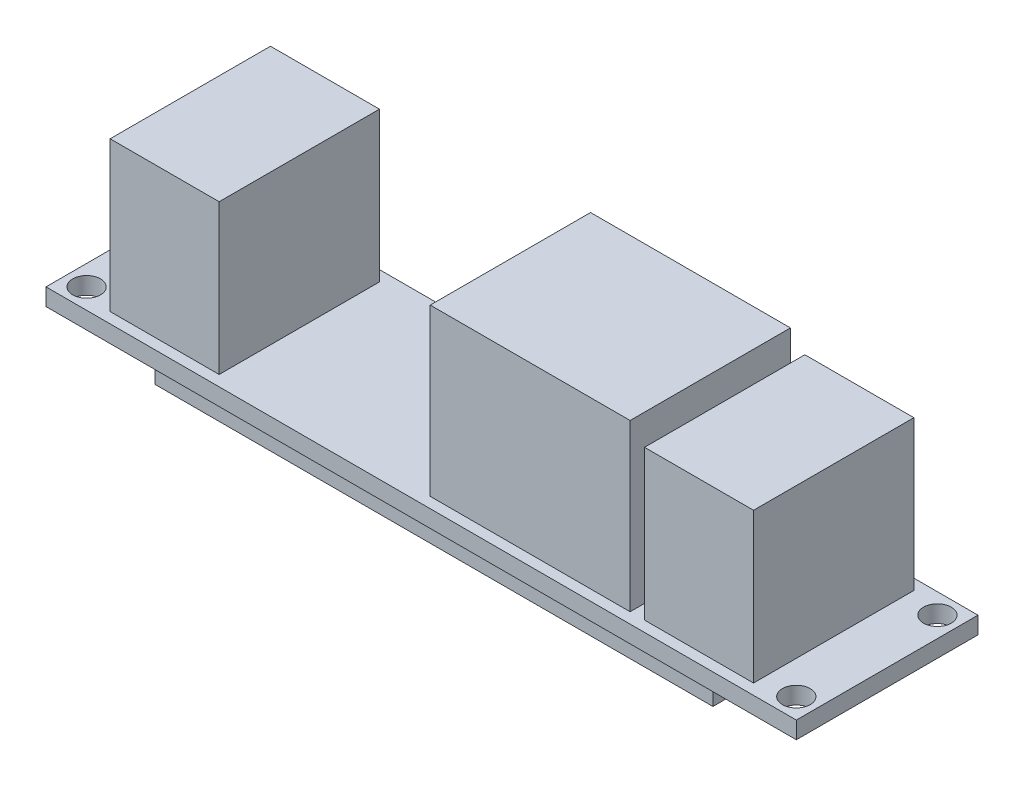
ISO-10303-21;
HEADER;
FILE_DESCRIPTION(('STEP AP214'),'2;1');
FILE_NAME('part.step','',(''),(''),'','','');
FILE_SCHEMA(('AUTOMOTIVE_DESIGN { 1 0 10303 214 1 1 1 1 }'));
ENDSEC;
DATA;
#1=APPLICATION_CONTEXT('core data for automotive mechanical design processes');
#2=APPLICATION_PROTOCOL_DEFINITION('international standard','automotive_design',2000,#1);
#3=PRODUCT_CONTEXT('',#1,'mechanical');
#4=PRODUCT('Part','Part','',(#3));
#5=PRODUCT_RELATED_PRODUCT_CATEGORY('part','',(#4));
#6=PRODUCT_DEFINITION_FORMATION('','',#4);
#7=PRODUCT_DEFINITION_CONTEXT('part definition',#1,'design');
#8=PRODUCT_DEFINITION('design','',#6,#7);
#9=PRODUCT_DEFINITION_SHAPE('','',#8);
#10=(LENGTH_UNIT() NAMED_UNIT(*) SI_UNIT(.MILLI.,.METRE.));
#11=(NAMED_UNIT(*) PLANE_ANGLE_UNIT() SI_UNIT($,.RADIAN.));
#12=(NAMED_UNIT(*) SI_UNIT($,.STERADIAN.) SOLID_ANGLE_UNIT());
#13=UNCERTAINTY_MEASURE_WITH_UNIT(LENGTH_MEASURE(1.E-05),#10,'distance_accuracy_value','');
#14=(GEOMETRIC_REPRESENTATION_CONTEXT(3) GLOBAL_UNCERTAINTY_ASSIGNED_CONTEXT((#13)) GLOBAL_UNIT_ASSIGNED_CONTEXT((#10,
#11,#12)) REPRESENTATION_CONTEXT('',''));
#15=CARTESIAN_POINT('',(0.,0.,0.));
#16=DIRECTION('',(0.,0.,1.));
#17=DIRECTION('',(1.,0.,0.));
#18=AXIS2_PLACEMENT_3D('',#15,#16,#17);
#19=CARTESIAN_POINT('',(0.,-1.6,0.));
#20=DIRECTION('',(0.,-1.,0.));
#21=DIRECTION('',(0.,0.,-1.));
#22=AXIS2_PLACEMENT_3D('',#19,#20,#21);
#23=PLANE('',#22);
#24=CARTESIAN_POINT('',(-33.2,-1.6,6.6));
#25=DIRECTION('',(0.,1.,0.));
#26=DIRECTION('',(0.,0.,-1.));
#27=AXIS2_PLACEMENT_3D('',#24,#25,#26);
#28=CIRCLE('',#27,1.3);
#29=CARTESIAN_POINT('',(-33.2,-1.6,5.3));
#30=VERTEX_POINT('',#29);
#31=EDGE_CURVE('E291',#30,#30,#28,.T.);
#32=ORIENTED_EDGE('',*,*,#31,.T.);
#33=EDGE_LOOP('',(#32));
#34=FACE_BOUND('',#33,.T.);
#35=CARTESIAN_POINT('',(33.2,-1.6,6.6));
#36=DIRECTION('',(0.,1.,0.));
#37=DIRECTION('',(0.,0.,1.));
#38=AXIS2_PLACEMENT_3D('',#35,#36,#37);
#39=CIRCLE('',#38,1.3);
#40=CARTESIAN_POINT('',(33.2,-1.6,7.9));
#41=VERTEX_POINT('',#40);
#42=EDGE_CURVE('E297',#41,#41,#39,.T.);
#43=ORIENTED_EDGE('',*,*,#42,.T.);
#44=EDGE_LOOP('',(#43));
#45=FACE_BOUND('',#44,.T.);
#46=CARTESIAN_POINT('',(33.2,-1.6,-6.6));
#47=DIRECTION('',(0.,1.,0.));
#48=DIRECTION('',(0.,0.,-1.));
#49=AXIS2_PLACEMENT_3D('',#46,#47,#48);
#50=CIRCLE('',#49,1.3);
#51=CARTESIAN_POINT('',(33.2,-1.6,-7.9));
#52=VERTEX_POINT('',#51);
#53=EDGE_CURVE('E303',#52,#52,#50,.T.);
#54=ORIENTED_EDGE('',*,*,#53,.T.);
#55=EDGE_LOOP('',(#54));
#56=FACE_BOUND('',#55,.T.);
#57=CARTESIAN_POINT('',(-33.2,-1.6,-6.6));
#58=DIRECTION('',(0.,1.,0.));
#59=DIRECTION('',(0.,0.,1.));
#60=AXIS2_PLACEMENT_3D('',#57,#58,#59);
#61=CIRCLE('',#60,1.3);
#62=CARTESIAN_POINT('',(-33.2,-1.6,-5.3));
#63=VERTEX_POINT('',#62);
#64=EDGE_CURVE('E309',#63,#63,#61,.T.);
#65=ORIENTED_EDGE('',*,*,#64,.T.);
#66=EDGE_LOOP('',(#65));
#67=FACE_BOUND('',#66,.T.);
#68=DIRECTION('',(0.,0.,-1.));
#69=VECTOR('',#68,1.);
#70=CARTESIAN_POINT('',(35.1,-1.6,8.5));
#71=LINE('',#70,#69);
#72=CARTESIAN_POINT('',(35.1,-1.6,8.5));
#73=VERTEX_POINT('',#72);
#74=CARTESIAN_POINT('',(35.1,-1.6,-8.5));
#75=VERTEX_POINT('',#74);
#76=EDGE_CURVE('E315',#73,#75,#71,.T.);
#77=ORIENTED_EDGE('',*,*,#76,.F.);
#78=DIRECTION('',(1.,0.,0.));
#79=VECTOR('',#78,1.);
#80=CARTESIAN_POINT('',(-35.1,-1.6,8.5));
#81=LINE('',#80,#79);
#82=CARTESIAN_POINT('',(-35.1,-1.6,8.5));
#83=VERTEX_POINT('',#82);
#84=EDGE_CURVE('E325',#83,#73,#81,.T.);
#85=ORIENTED_EDGE('',*,*,#84,.F.);
#86=DIRECTION('',(0.,0.,1.));
#87=VECTOR('',#86,1.);
#88=CARTESIAN_POINT('',(-35.1,-1.6,8.5));
#89=LINE('',#88,#87);
#90=CARTESIAN_POINT('',(-35.1,-1.6,-8.5));
#91=VERTEX_POINT('',#90);
#92=EDGE_CURVE('E322',#91,#83,#89,.T.);
#93=ORIENTED_EDGE('',*,*,#92,.F.);
#94=DIRECTION('',(-1.,0.,0.));
#95=VECTOR('',#94,1.);
#96=CARTESIAN_POINT('',(-35.1,-1.6,-8.5));
#97=LINE('',#96,#95);
#98=EDGE_CURVE('E318',#75,#91,#97,.T.);
#99=ORIENTED_EDGE('',*,*,#98,.F.);
#100=EDGE_LOOP('',(#77,#85,#93,#99));
#101=FACE_BOUND('',#100,.T.);
#102=DIRECTION('',(-1.,0.,0.));
#103=VECTOR('',#102,1.);
#104=CARTESIAN_POINT('',(-26.1,-1.6,7.30352740908692));
#105=LINE('',#104,#103);
#106=CARTESIAN_POINT('',(26.1,-1.6,7.30352740908692));
#107=VERTEX_POINT('',#106);
#108=CARTESIAN_POINT('',(-26.1,-1.6,7.30352740908692));
#109=VERTEX_POINT('',#108);
#110=EDGE_CURVE('E656',#107,#109,#105,.T.);
#111=ORIENTED_EDGE('',*,*,#110,.F.);
#112=DIRECTION('',(0.,0.,1.));
#113=VECTOR('',#112,1.);
#114=CARTESIAN_POINT('',(26.1,-1.6,-7.30352740908692));
#115=LINE('',#114,#113);
#116=CARTESIAN_POINT('',(26.1,-1.6,-7.30352740908692));
#117=VERTEX_POINT('',#116);
#118=EDGE_CURVE('E196',#117,#107,#115,.T.);
#119=ORIENTED_EDGE('',*,*,#118,.F.);
#120=DIRECTION('',(1.,0.,0.));
#121=VECTOR('',#120,1.);
#122=CARTESIAN_POINT('',(-26.1,-1.6,-7.30352740908692));
#123=LINE('',#122,#121);
#124=CARTESIAN_POINT('',(-26.1,-1.6,-7.30352740908692));
#125=VERTEX_POINT('',#124);
#126=EDGE_CURVE('E192',#125,#117,#123,.T.);
#127=ORIENTED_EDGE('',*,*,#126,.F.);
#128=DIRECTION('',(0.,0.,-1.));
#129=VECTOR('',#128,1.);
#130=CARTESIAN_POINT('',(-26.1,-1.6,-7.30352740908692));
#131=LINE('',#130,#129);
#132=EDGE_CURVE('E653',#109,#125,#131,.T.);
#133=ORIENTED_EDGE('',*,*,#132,.F.);
#134=EDGE_LOOP('',(#111,#119,#127,#133));
#135=FACE_BOUND('',#134,.T.);
#136=ADVANCED_FACE('F35',(#34,#45,#56,#67,#101,#135),#23,.T.);
#137=CARTESIAN_POINT('',(0.,0.,0.));
#138=DIRECTION('',(0.,-1.,0.));
#139=DIRECTION('',(0.,0.,-1.));
#140=AXIS2_PLACEMENT_3D('',#137,#138,#139);
#141=PLANE('',#140);
#142=DIRECTION('',(1.,0.,0.));
#143=VECTOR('',#142,1.);
#144=CARTESIAN_POINT('',(19.9,0.,7.5));
#145=LINE('',#144,#143);
#146=CARTESIAN_POINT('',(19.9,0.,7.5));
#147=VERTEX_POINT('',#146);
#148=CARTESIAN_POINT('',(30.1,0.,7.5));
#149=VERTEX_POINT('',#148);
#150=EDGE_CURVE('E233',#147,#149,#145,.T.);
#151=ORIENTED_EDGE('',*,*,#150,.F.);
#152=DIRECTION('',(0.,0.,-1.));
#153=VECTOR('',#152,1.);
#154=CARTESIAN_POINT('',(19.9,0.,7.5));
#155=LINE('',#154,#153);
#156=CARTESIAN_POINT('',(19.9,0.,-7.5));
#157=VERTEX_POINT('',#156);
#158=EDGE_CURVE('E257',#147,#157,#155,.T.);
#159=ORIENTED_EDGE('',*,*,#158,.T.);
#160=DIRECTION('',(1.,0.,0.));
#161=VECTOR('',#160,1.);
#162=CARTESIAN_POINT('',(19.9,0.,-7.5));
#163=LINE('',#162,#161);
#164=CARTESIAN_POINT('',(30.1,0.,-7.5));
#165=VERTEX_POINT('',#164);
#166=EDGE_CURVE('E243',#157,#165,#163,.T.);
#167=ORIENTED_EDGE('',*,*,#166,.T.);
#168=DIRECTION('',(0.,0.,-1.));
#169=VECTOR('',#168,1.);
#170=CARTESIAN_POINT('',(30.1,0.,7.5));
#171=LINE('',#170,#169);
#172=EDGE_CURVE('E254',#149,#165,#171,.T.);
#173=ORIENTED_EDGE('',*,*,#172,.F.);
#174=EDGE_LOOP('',(#151,#159,#167,#173));
#175=FACE_BOUND('',#174,.T.);
#176=DIRECTION('',(0.,0.,-1.));
#177=VECTOR('',#176,1.);
#178=CARTESIAN_POINT('',(35.1,0.,8.5));
#179=LINE('',#178,#177);
#180=CARTESIAN_POINT('',(35.1,0.,8.5));
#181=VERTEX_POINT('',#180);
#182=CARTESIAN_POINT('',(35.1,0.,-8.5));
#183=VERTEX_POINT('',#182);
#184=EDGE_CURVE('E312',#181,#183,#179,.T.);
#185=ORIENTED_EDGE('',*,*,#184,.T.);
#186=DIRECTION('',(-1.,0.,0.));
#187=VECTOR('',#186,1.);
#188=CARTESIAN_POINT('',(-35.1,0.,-8.5));
#189=LINE('',#188,#187);
#190=CARTESIAN_POINT('',(-35.1,0.,-8.5));
#191=VERTEX_POINT('',#190);
#192=EDGE_CURVE('E330',#183,#191,#189,.T.);
#193=ORIENTED_EDGE('',*,*,#192,.T.);
#194=DIRECTION('',(0.,0.,1.));
#195=VECTOR('',#194,1.);
#196=CARTESIAN_POINT('',(-35.1,0.,8.5));
#197=LINE('',#196,#195);
#198=CARTESIAN_POINT('',(-35.1,0.,8.5));
#199=VERTEX_POINT('',#198);
#200=EDGE_CURVE('E333',#191,#199,#197,.T.);
#201=ORIENTED_EDGE('',*,*,#200,.T.);
#202=DIRECTION('',(1.,0.,0.));
#203=VECTOR('',#202,1.);
#204=CARTESIAN_POINT('',(-35.1,0.,8.5));
#205=LINE('',#204,#203);
#206=EDGE_CURVE('E319',#199,#181,#205,.T.);
#207=ORIENTED_EDGE('',*,*,#206,.T.);
#208=EDGE_LOOP('',(#185,#193,#201,#207));
#209=FACE_BOUND('',#208,.T.);
#210=CARTESIAN_POINT('',(-33.2,0.,-6.6));
#211=DIRECTION('',(0.,1.,0.));
#212=DIRECTION('',(0.,0.,1.));
#213=AXIS2_PLACEMENT_3D('',#210,#211,#212);
#214=CIRCLE('',#213,1.3);
#215=CARTESIAN_POINT('',(-33.2,0.,-5.3));
#216=VERTEX_POINT('',#215);
#217=EDGE_CURVE('E306',#216,#216,#214,.T.);
#218=ORIENTED_EDGE('',*,*,#217,.F.);
#219=EDGE_LOOP('',(#218));
#220=FACE_BOUND('',#219,.T.);
#221=CARTESIAN_POINT('',(33.2,0.,-6.6));
#222=DIRECTION('',(0.,1.,0.));
#223=DIRECTION('',(0.,0.,-1.));
#224=AXIS2_PLACEMENT_3D('',#221,#222,#223);
#225=CIRCLE('',#224,1.3);
#226=CARTESIAN_POINT('',(33.2,0.,-7.9));
#227=VERTEX_POINT('',#226);
#228=EDGE_CURVE('E300',#227,#227,#225,.T.);
#229=ORIENTED_EDGE('',*,*,#228,.F.);
#230=EDGE_LOOP('',(#229));
#231=FACE_BOUND('',#230,.T.);
#232=CARTESIAN_POINT('',(33.2,0.,6.6));
#233=DIRECTION('',(0.,1.,0.));
#234=DIRECTION('',(0.,0.,1.));
#235=AXIS2_PLACEMENT_3D('',#232,#233,#234);
#236=CIRCLE('',#235,1.3);
#237=CARTESIAN_POINT('',(33.2,0.,7.9));
#238=VERTEX_POINT('',#237);
#239=EDGE_CURVE('E294',#238,#238,#236,.T.);
#240=ORIENTED_EDGE('',*,*,#239,.F.);
#241=EDGE_LOOP('',(#240));
#242=FACE_BOUND('',#241,.T.);
#243=CARTESIAN_POINT('',(-33.2,0.,6.6));
#244=DIRECTION('',(0.,1.,0.));
#245=DIRECTION('',(0.,0.,-1.));
#246=AXIS2_PLACEMENT_3D('',#243,#244,#245);
#247=CIRCLE('',#246,1.3);
#248=CARTESIAN_POINT('',(-33.2,0.,5.3));
#249=VERTEX_POINT('',#248);
#250=EDGE_CURVE('E290',#249,#249,#247,.T.);
#251=ORIENTED_EDGE('',*,*,#250,.F.);
#252=EDGE_LOOP('',(#251));
#253=FACE_BOUND('',#252,.T.);
#254=DIRECTION('',(1.,0.,0.));
#255=VECTOR('',#254,1.);
#256=CARTESIAN_POINT('',(-0.150000000000004,0.,7.5));
#257=LINE('',#256,#255);
#258=CARTESIAN_POINT('',(-0.150000000000004,0.,7.5));
#259=VERTEX_POINT('',#258);
#260=CARTESIAN_POINT('',(18.55,0.,7.5));
#261=VERTEX_POINT('',#260);
#262=EDGE_CURVE('E263',#259,#261,#257,.T.);
#263=ORIENTED_EDGE('',*,*,#262,.F.);
#264=DIRECTION('',(0.,0.,-1.));
#265=VECTOR('',#264,1.);
#266=CARTESIAN_POINT('',(-0.150000000000004,0.,7.5));
#267=LINE('',#266,#265);
#268=CARTESIAN_POINT('',(-0.150000000000004,0.,-7.5));
#269=VERTEX_POINT('',#268);
#270=EDGE_CURVE('E287',#259,#269,#267,.T.);
#271=ORIENTED_EDGE('',*,*,#270,.T.);
#272=DIRECTION('',(1.,0.,0.));
#273=VECTOR('',#272,1.);
#274=CARTESIAN_POINT('',(-0.150000000000004,0.,-7.5));
#275=LINE('',#274,#273);
#276=CARTESIAN_POINT('',(18.55,0.,-7.5));
#277=VERTEX_POINT('',#276);
#278=EDGE_CURVE('E273',#269,#277,#275,.T.);
#279=ORIENTED_EDGE('',*,*,#278,.T.);
#280=DIRECTION('',(0.,0.,-1.));
#281=VECTOR('',#280,1.);
#282=CARTESIAN_POINT('',(18.55,0.,7.5));
#283=LINE('',#282,#281);
#284=EDGE_CURVE('E284',#261,#277,#283,.T.);
#285=ORIENTED_EDGE('',*,*,#284,.F.);
#286=EDGE_LOOP('',(#263,#271,#279,#285));
#287=FACE_BOUND('',#286,.T.);
#288=DIRECTION('',(1.,0.,0.));
#289=VECTOR('',#288,1.);
#290=CARTESIAN_POINT('',(-30.1,0.,7.5));
#291=LINE('',#290,#289);
#292=CARTESIAN_POINT('',(-30.1,0.,7.5));
#293=VERTEX_POINT('',#292);
#294=CARTESIAN_POINT('',(-19.9,0.,7.5));
#295=VERTEX_POINT('',#294);
#296=EDGE_CURVE('E208',#293,#295,#291,.T.);
#297=ORIENTED_EDGE('',*,*,#296,.F.);
#298=DIRECTION('',(0.,0.,-1.));
#299=VECTOR('',#298,1.);
#300=CARTESIAN_POINT('',(-30.1,0.,7.5));
#301=LINE('',#300,#299);
#302=CARTESIAN_POINT('',(-30.1,0.,-7.5));
#303=VERTEX_POINT('',#302);
#304=EDGE_CURVE('E227',#293,#303,#301,.T.);
#305=ORIENTED_EDGE('',*,*,#304,.T.);
#306=DIRECTION('',(1.,0.,0.));
#307=VECTOR('',#306,1.);
#308=CARTESIAN_POINT('',(-30.1,0.,-7.5));
#309=LINE('',#308,#307);
#310=CARTESIAN_POINT('',(-19.9,0.,-7.5));
#311=VERTEX_POINT('',#310);
#312=EDGE_CURVE('E201',#303,#311,#309,.T.);
#313=ORIENTED_EDGE('',*,*,#312,.T.);
#314=DIRECTION('',(0.,0.,-1.));
#315=VECTOR('',#314,1.);
#316=CARTESIAN_POINT('',(-19.9,0.,7.5));
#317=LINE('',#316,#315);
#318=EDGE_CURVE('E225',#295,#311,#317,.T.);
#319=ORIENTED_EDGE('',*,*,#318,.F.);
#320=EDGE_LOOP('',(#297,#305,#313,#319));
#321=FACE_BOUND('',#320,.T.);
#322=ADVANCED_FACE('F348',(#175,#209,#220,#231,#242,#253,#287,#321),#141,.F.);
#323=CARTESIAN_POINT('',(35.1,-1.6,8.5));
#324=DIRECTION('',(1.,0.,0.));
#325=DIRECTION('',(0.,0.,-1.));
#326=AXIS2_PLACEMENT_3D('',#323,#324,#325);
#327=PLANE('',#326);
#328=ORIENTED_EDGE('',*,*,#184,.F.);
#329=DIRECTION('',(0.,1.,0.));
#330=VECTOR('',#329,1.);
#331=CARTESIAN_POINT('',(35.1,-1.6,8.5));
#332=LINE('',#331,#330);
#333=EDGE_CURVE('E11',#73,#181,#332,.T.);
#334=ORIENTED_EDGE('',*,*,#333,.F.);
#335=ORIENTED_EDGE('',*,*,#76,.T.);
#336=DIRECTION('',(0.,1.,0.));
#337=VECTOR('',#336,1.);
#338=CARTESIAN_POINT('',(35.1,-1.6,-8.5));
#339=LINE('',#338,#337);
#340=EDGE_CURVE('E39',#75,#183,#339,.T.);
#341=ORIENTED_EDGE('',*,*,#340,.T.);
#342=EDGE_LOOP('',(#328,#334,#335,#341));
#343=FACE_BOUND('',#342,.T.);
#344=ADVANCED_FACE('F37',(#343),#327,.T.);
#345=CARTESIAN_POINT('',(-35.1,-1.6,8.5));
#346=DIRECTION('',(0.,0.,1.));
#347=DIRECTION('',(1.,0.,0.));
#348=AXIS2_PLACEMENT_3D('',#345,#346,#347);
#349=PLANE('',#348);
#350=ORIENTED_EDGE('',*,*,#206,.F.);
#351=DIRECTION('',(0.,1.,0.));
#352=VECTOR('',#351,1.);
#353=CARTESIAN_POINT('',(-35.1,-1.6,8.5));
#354=LINE('',#353,#352);
#355=EDGE_CURVE('E44',#83,#199,#354,.T.);
#356=ORIENTED_EDGE('',*,*,#355,.F.);
#357=ORIENTED_EDGE('',*,*,#84,.T.);
#358=ORIENTED_EDGE('',*,*,#333,.T.);
#359=EDGE_LOOP('',(#350,#356,#357,#358));
#360=FACE_BOUND('',#359,.T.);
#361=ADVANCED_FACE('F352',(#360),#349,.T.);
#362=CARTESIAN_POINT('',(-35.1,-1.6,8.5));
#363=DIRECTION('',(-1.,0.,0.));
#364=DIRECTION('',(0.,0.,1.));
#365=AXIS2_PLACEMENT_3D('',#362,#363,#364);
#366=PLANE('',#365);
#367=ORIENTED_EDGE('',*,*,#200,.F.);
#368=DIRECTION('',(0.,1.,0.));
#369=VECTOR('',#368,1.);
#370=CARTESIAN_POINT('',(-35.1,-1.6,-8.5));
#371=LINE('',#370,#369);
#372=EDGE_CURVE('E338',#91,#191,#371,.T.);
#373=ORIENTED_EDGE('',*,*,#372,.F.);
#374=ORIENTED_EDGE('',*,*,#92,.T.);
#375=ORIENTED_EDGE('',*,*,#355,.T.);
#376=EDGE_LOOP('',(#367,#373,#374,#375));
#377=FACE_BOUND('',#376,.T.);
#378=ADVANCED_FACE('F358',(#377),#366,.T.);
#379=CARTESIAN_POINT('',(-35.1,-1.6,-8.5));
#380=DIRECTION('',(0.,0.,-1.));
#381=DIRECTION('',(-1.,0.,0.));
#382=AXIS2_PLACEMENT_3D('',#379,#380,#381);
#383=PLANE('',#382);
#384=ORIENTED_EDGE('',*,*,#192,.F.);
#385=ORIENTED_EDGE('',*,*,#340,.F.);
#386=ORIENTED_EDGE('',*,*,#98,.T.);
#387=ORIENTED_EDGE('',*,*,#372,.T.);
#388=EDGE_LOOP('',(#384,#385,#386,#387));
#389=FACE_BOUND('',#388,.T.);
#390=ADVANCED_FACE('F346',(#389),#383,.T.);
#391=CARTESIAN_POINT('',(-33.2,-1.6,-6.6));
#392=DIRECTION('',(0.,1.,0.));
#393=DIRECTION('',(0.,0.,1.));
#394=AXIS2_PLACEMENT_3D('',#391,#392,#393);
#395=CYLINDRICAL_SURFACE('',#394,1.3);
#396=ORIENTED_EDGE('',*,*,#64,.F.);
#397=EDGE_LOOP('',(#396));
#398=FACE_BOUND('',#397,.T.);
#399=ORIENTED_EDGE('',*,*,#217,.T.);
#400=EDGE_LOOP('',(#399));
#401=FACE_BOUND('',#400,.T.);
#402=ADVANCED_FACE('F365',(#398,#401),#395,.F.);
#403=CARTESIAN_POINT('',(33.2,-1.6,-6.6));
#404=DIRECTION('',(0.,1.,0.));
#405=DIRECTION('',(0.,0.,1.));
#406=AXIS2_PLACEMENT_3D('',#403,#404,#405);
#407=CYLINDRICAL_SURFACE('',#406,1.3);
#408=ORIENTED_EDGE('',*,*,#53,.F.);
#409=EDGE_LOOP('',(#408));
#410=FACE_BOUND('',#409,.T.);
#411=ORIENTED_EDGE('',*,*,#228,.T.);
#412=EDGE_LOOP('',(#411));
#413=FACE_BOUND('',#412,.T.);
#414=ADVANCED_FACE('F379',(#410,#413),#407,.F.);
#415=CARTESIAN_POINT('',(33.2,-1.6,6.6));
#416=DIRECTION('',(0.,1.,0.));
#417=DIRECTION('',(0.,0.,1.));
#418=AXIS2_PLACEMENT_3D('',#415,#416,#417);
#419=CYLINDRICAL_SURFACE('',#418,1.3);
#420=ORIENTED_EDGE('',*,*,#42,.F.);
#421=EDGE_LOOP('',(#420));
#422=FACE_BOUND('',#421,.T.);
#423=ORIENTED_EDGE('',*,*,#239,.T.);
#424=EDGE_LOOP('',(#423));
#425=FACE_BOUND('',#424,.T.);
#426=ADVANCED_FACE('F383',(#422,#425),#419,.F.);
#427=CARTESIAN_POINT('',(-33.2,-1.6,6.6));
#428=DIRECTION('',(0.,1.,0.));
#429=DIRECTION('',(0.,0.,1.));
#430=AXIS2_PLACEMENT_3D('',#427,#428,#429);
#431=CYLINDRICAL_SURFACE('',#430,1.3);
#432=ORIENTED_EDGE('',*,*,#31,.F.);
#433=EDGE_LOOP('',(#432));
#434=FACE_BOUND('',#433,.T.);
#435=ORIENTED_EDGE('',*,*,#250,.T.);
#436=EDGE_LOOP('',(#435));
#437=FACE_BOUND('',#436,.T.);
#438=ADVANCED_FACE('F387',(#434,#437),#431,.F.);
#439=CARTESIAN_POINT('',(-0.150000000000004,0.,7.5));
#440=DIRECTION('',(1.,0.,0.));
#441=DIRECTION('',(0.,0.,-1.));
#442=AXIS2_PLACEMENT_3D('',#439,#440,#441);
#443=PLANE('',#442);
#444=DIRECTION('',(0.,-1.,0.));
#445=VECTOR('',#444,1.);
#446=CARTESIAN_POINT('',(-0.150000000000004,0.,-7.5));
#447=LINE('',#446,#445);
#448=CARTESIAN_POINT('',(-0.150000000000004,15.5,-7.5));
#449=VERTEX_POINT('',#448);
#450=EDGE_CURVE('E260',#449,#269,#447,.T.);
#451=ORIENTED_EDGE('',*,*,#450,.T.);
#452=ORIENTED_EDGE('',*,*,#270,.F.);
#453=DIRECTION('',(0.,-1.,0.));
#454=VECTOR('',#453,1.);
#455=CARTESIAN_POINT('',(-0.150000000000004,0.,7.5));
#456=LINE('',#455,#454);
#457=CARTESIAN_POINT('',(-0.150000000000004,15.5,7.5));
#458=VERTEX_POINT('',#457);
#459=EDGE_CURVE('E261',#458,#259,#456,.T.);
#460=ORIENTED_EDGE('',*,*,#459,.F.);
#461=DIRECTION('',(0.,0.,-1.));
#462=VECTOR('',#461,1.);
#463=CARTESIAN_POINT('',(-0.150000000000004,15.5,7.5));
#464=LINE('',#463,#462);
#465=EDGE_CURVE('E270',#458,#449,#464,.T.);
#466=ORIENTED_EDGE('',*,*,#465,.T.);
#467=EDGE_LOOP('',(#451,#452,#460,#466));
#468=FACE_BOUND('',#467,.T.);
#469=ADVANCED_FACE('F391',(#468),#443,.F.);
#470=CARTESIAN_POINT('',(18.55,0.,7.5));
#471=DIRECTION('',(-1.,0.,0.));
#472=DIRECTION('',(0.,0.,1.));
#473=AXIS2_PLACEMENT_3D('',#470,#471,#472);
#474=PLANE('',#473);
#475=DIRECTION('',(0.,1.,0.));
#476=VECTOR('',#475,1.);
#477=CARTESIAN_POINT('',(18.55,0.,-7.5));
#478=LINE('',#477,#476);
#479=CARTESIAN_POINT('',(18.55,15.5,-7.5));
#480=VERTEX_POINT('',#479);
#481=EDGE_CURVE('E276',#277,#480,#478,.T.);
#482=ORIENTED_EDGE('',*,*,#481,.T.);
#483=DIRECTION('',(0.,0.,-1.));
#484=VECTOR('',#483,1.);
#485=CARTESIAN_POINT('',(18.55,15.5,7.5));
#486=LINE('',#485,#484);
#487=CARTESIAN_POINT('',(18.55,15.5,7.5));
#488=VERTEX_POINT('',#487);
#489=EDGE_CURVE('E281',#488,#480,#486,.T.);
#490=ORIENTED_EDGE('',*,*,#489,.F.);
#491=DIRECTION('',(0.,1.,0.));
#492=VECTOR('',#491,1.);
#493=CARTESIAN_POINT('',(18.55,0.,7.5));
#494=LINE('',#493,#492);
#495=EDGE_CURVE('E266',#261,#488,#494,.T.);
#496=ORIENTED_EDGE('',*,*,#495,.F.);
#497=ORIENTED_EDGE('',*,*,#284,.T.);
#498=EDGE_LOOP('',(#482,#490,#496,#497));
#499=FACE_BOUND('',#498,.T.);
#500=ADVANCED_FACE('F395',(#499),#474,.F.);
#501=CARTESIAN_POINT('',(-0.150000000000004,15.5,7.5));
#502=DIRECTION('',(0.,-1.,0.));
#503=DIRECTION('',(0.,0.,-1.));
#504=AXIS2_PLACEMENT_3D('',#501,#502,#503);
#505=PLANE('',#504);
#506=DIRECTION('',(-1.,0.,0.));
#507=VECTOR('',#506,1.);
#508=CARTESIAN_POINT('',(-0.150000000000004,15.5,-7.5));
#509=LINE('',#508,#507);
#510=EDGE_CURVE('E264',#480,#449,#509,.T.);
#511=ORIENTED_EDGE('',*,*,#510,.T.);
#512=ORIENTED_EDGE('',*,*,#465,.F.);
#513=DIRECTION('',(-1.,0.,0.));
#514=VECTOR('',#513,1.);
#515=CARTESIAN_POINT('',(-0.150000000000004,15.5,7.5));
#516=LINE('',#515,#514);
#517=EDGE_CURVE('E268',#488,#458,#516,.T.);
#518=ORIENTED_EDGE('',*,*,#517,.F.);
#519=ORIENTED_EDGE('',*,*,#489,.T.);
#520=EDGE_LOOP('',(#511,#512,#518,#519));
#521=FACE_BOUND('',#520,.T.);
#522=ADVANCED_FACE('F399',(#521),#505,.F.);
#523=CARTESIAN_POINT('',(0.,0.,7.5));
#524=DIRECTION('',(0.,0.,-1.));
#525=DIRECTION('',(-1.,0.,0.));
#526=AXIS2_PLACEMENT_3D('',#523,#524,#525);
#527=PLANE('',#526);
#528=ORIENTED_EDGE('',*,*,#459,.T.);
#529=ORIENTED_EDGE('',*,*,#262,.T.);
#530=ORIENTED_EDGE('',*,*,#495,.T.);
#531=ORIENTED_EDGE('',*,*,#517,.T.);
#532=EDGE_LOOP('',(#528,#529,#530,#531));
#533=FACE_BOUND('',#532,.T.);
#534=ADVANCED_FACE('F403',(#533),#527,.F.);
#535=CARTESIAN_POINT('',(0.,0.,-7.5));
#536=DIRECTION('',(0.,0.,-1.));
#537=DIRECTION('',(-1.,0.,0.));
#538=AXIS2_PLACEMENT_3D('',#535,#536,#537);
#539=PLANE('',#538);
#540=ORIENTED_EDGE('',*,*,#450,.F.);
#541=ORIENTED_EDGE('',*,*,#510,.F.);
#542=ORIENTED_EDGE('',*,*,#481,.F.);
#543=ORIENTED_EDGE('',*,*,#278,.F.);
#544=EDGE_LOOP('',(#540,#541,#542,#543));
#545=FACE_BOUND('',#544,.T.);
#546=ADVANCED_FACE('F405',(#545),#539,.T.);
#547=CARTESIAN_POINT('',(19.9,0.,7.5));
#548=DIRECTION('',(1.,0.,0.));
#549=DIRECTION('',(0.,0.,-1.));
#550=AXIS2_PLACEMENT_3D('',#547,#548,#549);
#551=PLANE('',#550);
#552=DIRECTION('',(0.,-1.,0.));
#553=VECTOR('',#552,1.);
#554=CARTESIAN_POINT('',(19.9,0.,-7.5));
#555=LINE('',#554,#553);
#556=CARTESIAN_POINT('',(19.9,14.,-7.5));
#557=VERTEX_POINT('',#556);
#558=EDGE_CURVE('E230',#557,#157,#555,.T.);
#559=ORIENTED_EDGE('',*,*,#558,.T.);
#560=ORIENTED_EDGE('',*,*,#158,.F.);
#561=DIRECTION('',(0.,-1.,0.));
#562=VECTOR('',#561,1.);
#563=CARTESIAN_POINT('',(19.9,0.,7.5));
#564=LINE('',#563,#562);
#565=CARTESIAN_POINT('',(19.9,14.,7.5));
#566=VERTEX_POINT('',#565);
#567=EDGE_CURVE('E231',#566,#147,#564,.T.);
#568=ORIENTED_EDGE('',*,*,#567,.F.);
#569=DIRECTION('',(0.,0.,-1.));
#570=VECTOR('',#569,1.);
#571=CARTESIAN_POINT('',(19.9,14.,7.5));
#572=LINE('',#571,#570);
#573=EDGE_CURVE('E240',#566,#557,#572,.T.);
#574=ORIENTED_EDGE('',*,*,#573,.T.);
#575=EDGE_LOOP('',(#559,#560,#568,#574));
#576=FACE_BOUND('',#575,.T.);
#577=ADVANCED_FACE('F408',(#576),#551,.F.);
#578=CARTESIAN_POINT('',(30.1,0.,7.5));
#579=DIRECTION('',(-1.,0.,0.));
#580=DIRECTION('',(0.,0.,1.));
#581=AXIS2_PLACEMENT_3D('',#578,#579,#580);
#582=PLANE('',#581);
#583=DIRECTION('',(0.,1.,0.));
#584=VECTOR('',#583,1.);
#585=CARTESIAN_POINT('',(30.1,0.,-7.5));
#586=LINE('',#585,#584);
#587=CARTESIAN_POINT('',(30.1,14.,-7.5));
#588=VERTEX_POINT('',#587);
#589=EDGE_CURVE('E246',#165,#588,#586,.T.);
#590=ORIENTED_EDGE('',*,*,#589,.T.);
#591=DIRECTION('',(0.,0.,-1.));
#592=VECTOR('',#591,1.);
#593=CARTESIAN_POINT('',(30.1,14.,7.5));
#594=LINE('',#593,#592);
#595=CARTESIAN_POINT('',(30.1,14.,7.5));
#596=VERTEX_POINT('',#595);
#597=EDGE_CURVE('E251',#596,#588,#594,.T.);
#598=ORIENTED_EDGE('',*,*,#597,.F.);
#599=DIRECTION('',(0.,1.,0.));
#600=VECTOR('',#599,1.);
#601=CARTESIAN_POINT('',(30.1,0.,7.5));
#602=LINE('',#601,#600);
#603=EDGE_CURVE('E236',#149,#596,#602,.T.);
#604=ORIENTED_EDGE('',*,*,#603,.F.);
#605=ORIENTED_EDGE('',*,*,#172,.T.);
#606=EDGE_LOOP('',(#590,#598,#604,#605));
#607=FACE_BOUND('',#606,.T.);
#608=ADVANCED_FACE('F415',(#607),#582,.F.);
#609=CARTESIAN_POINT('',(19.9,14.,7.5));
#610=DIRECTION('',(0.,-1.,0.));
#611=DIRECTION('',(0.,0.,-1.));
#612=AXIS2_PLACEMENT_3D('',#609,#610,#611);
#613=PLANE('',#612);
#614=DIRECTION('',(-1.,0.,0.));
#615=VECTOR('',#614,1.);
#616=CARTESIAN_POINT('',(19.9,14.,-7.5));
#617=LINE('',#616,#615);
#618=EDGE_CURVE('E234',#588,#557,#617,.T.);
#619=ORIENTED_EDGE('',*,*,#618,.T.);
#620=ORIENTED_EDGE('',*,*,#573,.F.);
#621=DIRECTION('',(-1.,0.,0.));
#622=VECTOR('',#621,1.);
#623=CARTESIAN_POINT('',(19.9,14.,7.5));
#624=LINE('',#623,#622);
#625=EDGE_CURVE('E238',#596,#566,#624,.T.);
#626=ORIENTED_EDGE('',*,*,#625,.F.);
#627=ORIENTED_EDGE('',*,*,#597,.T.);
#628=EDGE_LOOP('',(#619,#620,#626,#627));
#629=FACE_BOUND('',#628,.T.);
#630=ADVANCED_FACE('F419',(#629),#613,.F.);
#631=CARTESIAN_POINT('',(0.,0.,7.5));
#632=DIRECTION('',(0.,0.,-1.));
#633=DIRECTION('',(-1.,0.,0.));
#634=AXIS2_PLACEMENT_3D('',#631,#632,#633);
#635=PLANE('',#634);
#636=ORIENTED_EDGE('',*,*,#567,.T.);
#637=ORIENTED_EDGE('',*,*,#150,.T.);
#638=ORIENTED_EDGE('',*,*,#603,.T.);
#639=ORIENTED_EDGE('',*,*,#625,.T.);
#640=EDGE_LOOP('',(#636,#637,#638,#639));
#641=FACE_BOUND('',#640,.T.);
#642=ADVANCED_FACE('F423',(#641),#635,.F.);
#643=CARTESIAN_POINT('',(0.,0.,-7.5));
#644=DIRECTION('',(0.,0.,-1.));
#645=DIRECTION('',(-1.,0.,0.));
#646=AXIS2_PLACEMENT_3D('',#643,#644,#645);
#647=PLANE('',#646);
#648=ORIENTED_EDGE('',*,*,#558,.F.);
#649=ORIENTED_EDGE('',*,*,#618,.F.);
#650=ORIENTED_EDGE('',*,*,#589,.F.);
#651=ORIENTED_EDGE('',*,*,#166,.F.);
#652=EDGE_LOOP('',(#648,#649,#650,#651));
#653=FACE_BOUND('',#652,.T.);
#654=ADVANCED_FACE('F425',(#653),#647,.T.);
#655=CARTESIAN_POINT('',(-30.1,0.,7.5));
#656=DIRECTION('',(1.,0.,0.));
#657=DIRECTION('',(0.,0.,-1.));
#658=AXIS2_PLACEMENT_3D('',#655,#656,#657);
#659=PLANE('',#658);
#660=DIRECTION('',(0.,-1.,0.));
#661=VECTOR('',#660,1.);
#662=CARTESIAN_POINT('',(-30.1,0.,-7.5));
#663=LINE('',#662,#661);
#664=CARTESIAN_POINT('',(-30.1,14.,-7.5));
#665=VERTEX_POINT('',#664);
#666=EDGE_CURVE('E198',#665,#303,#663,.T.);
#667=ORIENTED_EDGE('',*,*,#666,.T.);
#668=ORIENTED_EDGE('',*,*,#304,.F.);
#669=DIRECTION('',(0.,-1.,0.));
#670=VECTOR('',#669,1.);
#671=CARTESIAN_POINT('',(-30.1,0.,7.5));
#672=LINE('',#671,#670);
#673=CARTESIAN_POINT('',(-30.1,14.,7.5));
#674=VERTEX_POINT('',#673);
#675=EDGE_CURVE('E206',#674,#293,#672,.T.);
#676=ORIENTED_EDGE('',*,*,#675,.F.);
#677=DIRECTION('',(0.,0.,-1.));
#678=VECTOR('',#677,1.);
#679=CARTESIAN_POINT('',(-30.1,14.,7.5));
#680=LINE('',#679,#678);
#681=EDGE_CURVE('E214',#674,#665,#680,.T.);
#682=ORIENTED_EDGE('',*,*,#681,.T.);
#683=EDGE_LOOP('',(#667,#668,#676,#682));
#684=FACE_BOUND('',#683,.T.);
#685=ADVANCED_FACE('F428',(#684),#659,.F.);
#686=CARTESIAN_POINT('',(-19.9,0.,7.5));
#687=DIRECTION('',(-1.,0.,0.));
#688=DIRECTION('',(0.,0.,1.));
#689=AXIS2_PLACEMENT_3D('',#686,#687,#688);
#690=PLANE('',#689);
#691=DIRECTION('',(0.,1.,0.));
#692=VECTOR('',#691,1.);
#693=CARTESIAN_POINT('',(-19.9,0.,-7.5));
#694=LINE('',#693,#692);
#695=CARTESIAN_POINT('',(-19.9,14.,-7.5));
#696=VERTEX_POINT('',#695);
#697=EDGE_CURVE('E60',#311,#696,#694,.T.);
#698=ORIENTED_EDGE('',*,*,#697,.T.);
#699=DIRECTION('',(0.,0.,-1.));
#700=VECTOR('',#699,1.);
#701=CARTESIAN_POINT('',(-19.9,14.,7.5));
#702=LINE('',#701,#700);
#703=CARTESIAN_POINT('',(-19.9,14.,7.5));
#704=VERTEX_POINT('',#703);
#705=EDGE_CURVE('E222',#704,#696,#702,.T.);
#706=ORIENTED_EDGE('',*,*,#705,.F.);
#707=DIRECTION('',(0.,1.,0.));
#708=VECTOR('',#707,1.);
#709=CARTESIAN_POINT('',(-19.9,0.,7.5));
#710=LINE('',#709,#708);
#711=EDGE_CURVE('E211',#295,#704,#710,.T.);
#712=ORIENTED_EDGE('',*,*,#711,.F.);
#713=ORIENTED_EDGE('',*,*,#318,.T.);
#714=EDGE_LOOP('',(#698,#706,#712,#713));
#715=FACE_BOUND('',#714,.T.);
#716=ADVANCED_FACE('F435',(#715),#690,.F.);
#717=CARTESIAN_POINT('',(-30.1,14.,7.5));
#718=DIRECTION('',(0.,-1.,0.));
#719=DIRECTION('',(0.,0.,-1.));
#720=AXIS2_PLACEMENT_3D('',#717,#718,#719);
#721=PLANE('',#720);
#722=DIRECTION('',(-1.,0.,0.));
#723=VECTOR('',#722,1.);
#724=CARTESIAN_POINT('',(-30.1,14.,-7.5));
#725=LINE('',#724,#723);
#726=EDGE_CURVE('E209',#696,#665,#725,.T.);
#727=ORIENTED_EDGE('',*,*,#726,.T.);
#728=ORIENTED_EDGE('',*,*,#681,.F.);
#729=DIRECTION('',(-1.,0.,0.));
#730=VECTOR('',#729,1.);
#731=CARTESIAN_POINT('',(-30.1,14.,7.5));
#732=LINE('',#731,#730);
#733=EDGE_CURVE('E213',#704,#674,#732,.T.);
#734=ORIENTED_EDGE('',*,*,#733,.F.);
#735=ORIENTED_EDGE('',*,*,#705,.T.);
#736=EDGE_LOOP('',(#727,#728,#734,#735));
#737=FACE_BOUND('',#736,.T.);
#738=ADVANCED_FACE('F439',(#737),#721,.F.);
#739=CARTESIAN_POINT('',(0.,0.,7.5));
#740=DIRECTION('',(0.,0.,-1.));
#741=DIRECTION('',(-1.,0.,0.));
#742=AXIS2_PLACEMENT_3D('',#739,#740,#741);
#743=PLANE('',#742);
#744=ORIENTED_EDGE('',*,*,#675,.T.);
#745=ORIENTED_EDGE('',*,*,#296,.T.);
#746=ORIENTED_EDGE('',*,*,#711,.T.);
#747=ORIENTED_EDGE('',*,*,#733,.T.);
#748=EDGE_LOOP('',(#744,#745,#746,#747));
#749=FACE_BOUND('',#748,.T.);
#750=ADVANCED_FACE('F443',(#749),#743,.F.);
#751=CARTESIAN_POINT('',(0.,0.,-7.5));
#752=DIRECTION('',(0.,0.,-1.));
#753=DIRECTION('',(-1.,0.,0.));
#754=AXIS2_PLACEMENT_3D('',#751,#752,#753);
#755=PLANE('',#754);
#756=ORIENTED_EDGE('',*,*,#666,.F.);
#757=ORIENTED_EDGE('',*,*,#726,.F.);
#758=ORIENTED_EDGE('',*,*,#697,.F.);
#759=ORIENTED_EDGE('',*,*,#312,.F.);
#760=EDGE_LOOP('',(#756,#757,#758,#759));
#761=FACE_BOUND('',#760,.T.);
#762=ADVANCED_FACE('F445',(#761),#755,.T.);
#763=CARTESIAN_POINT('',(26.1,-4.,-7.30352740908692));
#764=DIRECTION('',(-1.,0.,0.));
#765=DIRECTION('',(0.,0.,1.));
#766=AXIS2_PLACEMENT_3D('',#763,#764,#765);
#767=PLANE('',#766);
#768=ORIENTED_EDGE('',*,*,#118,.T.);
#769=DIRECTION('',(0.,1.,0.));
#770=VECTOR('',#769,1.);
#771=CARTESIAN_POINT('',(26.1,-4.,7.30352740908692));
#772=LINE('',#771,#770);
#773=CARTESIAN_POINT('',(26.1,-4.,7.30352740908692));
#774=VERTEX_POINT('',#773);
#775=EDGE_CURVE('E177',#774,#107,#772,.T.);
#776=ORIENTED_EDGE('',*,*,#775,.F.);
#777=DIRECTION('',(0.,0.,1.));
#778=VECTOR('',#777,1.);
#779=CARTESIAN_POINT('',(26.1,-4.,-7.30352740908692));
#780=LINE('',#779,#778);
#781=CARTESIAN_POINT('',(26.1,-4.,-7.30352740908692));
#782=VERTEX_POINT('',#781);
#783=EDGE_CURVE('E184',#782,#774,#780,.T.);
#784=ORIENTED_EDGE('',*,*,#783,.F.);
#785=DIRECTION('',(0.,1.,0.));
#786=VECTOR('',#785,1.);
#787=CARTESIAN_POINT('',(26.1,-4.,-7.30352740908692));
#788=LINE('',#787,#786);
#789=EDGE_CURVE('E651',#782,#117,#788,.T.);
#790=ORIENTED_EDGE('',*,*,#789,.T.);
#791=EDGE_LOOP('',(#768,#776,#784,#790));
#792=FACE_BOUND('',#791,.T.);
#793=ADVANCED_FACE('F194',(#792),#767,.F.);
#794=CARTESIAN_POINT('',(-26.1,-4.,7.30352740908692));
#795=DIRECTION('',(0.,0.,-1.));
#796=DIRECTION('',(-1.,0.,0.));
#797=AXIS2_PLACEMENT_3D('',#794,#795,#796);
#798=PLANE('',#797);
#799=ORIENTED_EDGE('',*,*,#110,.T.);
#800=DIRECTION('',(0.,1.,0.));
#801=VECTOR('',#800,1.);
#802=CARTESIAN_POINT('',(-26.1,-4.,7.30352740908692));
#803=LINE('',#802,#801);
#804=CARTESIAN_POINT('',(-26.1,-4.,7.30352740908692));
#805=VERTEX_POINT('',#804);
#806=EDGE_CURVE('E180',#805,#109,#803,.T.);
#807=ORIENTED_EDGE('',*,*,#806,.F.);
#808=DIRECTION('',(-1.,0.,0.));
#809=VECTOR('',#808,1.);
#810=CARTESIAN_POINT('',(-26.1,-4.,7.30352740908692));
#811=LINE('',#810,#809);
#812=EDGE_CURVE('E173',#774,#805,#811,.T.);
#813=ORIENTED_EDGE('',*,*,#812,.F.);
#814=ORIENTED_EDGE('',*,*,#775,.T.);
#815=EDGE_LOOP('',(#799,#807,#813,#814));
#816=FACE_BOUND('',#815,.T.);
#817=ADVANCED_FACE('F175',(#816),#798,.F.);
#818=CARTESIAN_POINT('',(-26.1,-4.,-7.30352740908692));
#819=DIRECTION('',(1.,0.,0.));
#820=DIRECTION('',(0.,0.,-1.));
#821=AXIS2_PLACEMENT_3D('',#818,#819,#820);
#822=PLANE('',#821);
#823=ORIENTED_EDGE('',*,*,#132,.T.);
#824=DIRECTION('',(0.,1.,0.));
#825=VECTOR('',#824,1.);
#826=CARTESIAN_POINT('',(-26.1,-4.,-7.30352740908692));
#827=LINE('',#826,#825);
#828=CARTESIAN_POINT('',(-26.1,-4.,-7.30352740908692));
#829=VERTEX_POINT('',#828);
#830=EDGE_CURVE('E52',#829,#125,#827,.T.);
#831=ORIENTED_EDGE('',*,*,#830,.F.);
#832=DIRECTION('',(0.,0.,-1.));
#833=VECTOR('',#832,1.);
#834=CARTESIAN_POINT('',(-26.1,-4.,-7.30352740908692));
#835=LINE('',#834,#833);
#836=EDGE_CURVE('E183',#805,#829,#835,.T.);
#837=ORIENTED_EDGE('',*,*,#836,.F.);
#838=ORIENTED_EDGE('',*,*,#806,.T.);
#839=EDGE_LOOP('',(#823,#831,#837,#838));
#840=FACE_BOUND('',#839,.T.);
#841=ADVANCED_FACE('F455',(#840),#822,.F.);
#842=CARTESIAN_POINT('',(-26.1,-4.,-7.30352740908692));
#843=DIRECTION('',(0.,0.,1.));
#844=DIRECTION('',(1.,0.,0.));
#845=AXIS2_PLACEMENT_3D('',#842,#843,#844);
#846=PLANE('',#845);
#847=ORIENTED_EDGE('',*,*,#126,.T.);
#848=ORIENTED_EDGE('',*,*,#789,.F.);
#849=DIRECTION('',(1.,0.,0.));
#850=VECTOR('',#849,1.);
#851=CARTESIAN_POINT('',(-26.1,-4.,-7.30352740908692));
#852=LINE('',#851,#850);
#853=EDGE_CURVE('E188',#829,#782,#852,.T.);
#854=ORIENTED_EDGE('',*,*,#853,.F.);
#855=ORIENTED_EDGE('',*,*,#830,.T.);
#856=EDGE_LOOP('',(#847,#848,#854,#855));
#857=FACE_BOUND('',#856,.T.);
#858=ADVANCED_FACE('F458',(#857),#846,.F.);
#859=CARTESIAN_POINT('',(0.,-4.,0.));
#860=DIRECTION('',(0.,1.,0.));
#861=DIRECTION('',(0.,0.,1.));
#862=AXIS2_PLACEMENT_3D('',#859,#860,#861);
#863=PLANE('',#862);
#864=ORIENTED_EDGE('',*,*,#783,.T.);
#865=ORIENTED_EDGE('',*,*,#812,.T.);
#866=ORIENTED_EDGE('',*,*,#836,.T.);
#867=ORIENTED_EDGE('',*,*,#853,.T.);
#868=EDGE_LOOP('',(#864,#865,#866,#867));
#869=FACE_BOUND('',#868,.T.);
#870=ADVANCED_FACE('F187',(#869),#863,.F.);
#871=CLOSED_SHELL('',(#136,#322,#344,#361,#378,#390,#402,#414,#426,#438,#469,#500,#522,#534,
#546,#577,#608,#630,#642,#654,#685,#716,#738,#750,#762,#793,#817,#841,#858,#870));
#872=MANIFOLD_SOLID_BREP('B2',#871);
#873=ADVANCED_BREP_SHAPE_REPRESENTATION('',(#18,#872),#14);
#874=SHAPE_DEFINITION_REPRESENTATION(#9,#873);
ENDSEC;
END-ISO-10303-21;
